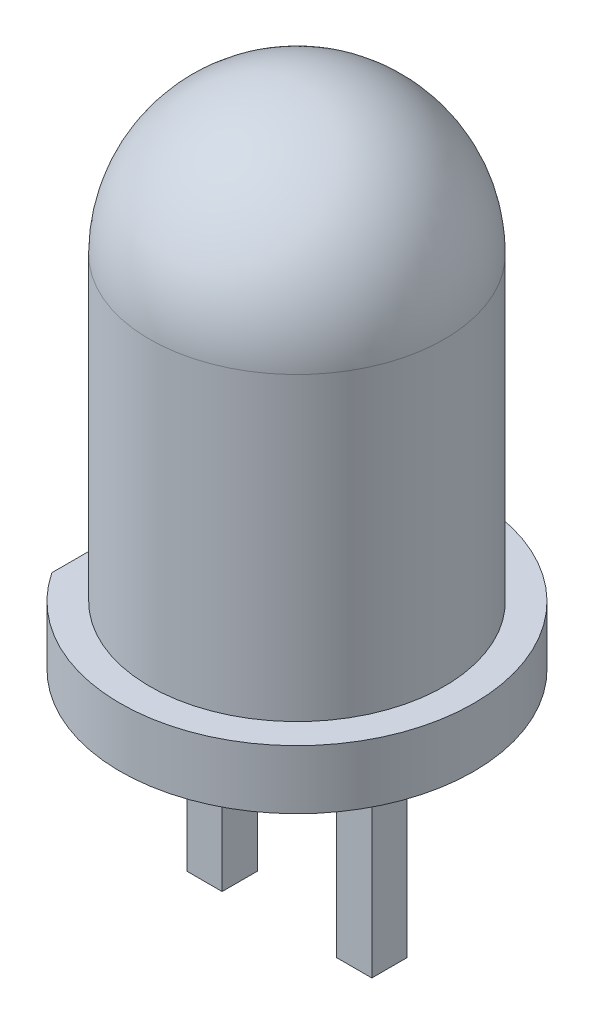
ISO-10303-21;
HEADER;
FILE_DESCRIPTION(('STEP AP214'),'2;1');
FILE_NAME('part.step','',(''),(''),'','','');
FILE_SCHEMA(('AUTOMOTIVE_DESIGN { 1 0 10303 214 1 1 1 1 }'));
ENDSEC;
DATA;
#1=APPLICATION_CONTEXT('core data for automotive mechanical design processes');
#2=APPLICATION_PROTOCOL_DEFINITION('international standard','automotive_design',2000,#1);
#3=PRODUCT_CONTEXT('',#1,'mechanical');
#4=PRODUCT('Part','Part','',(#3));
#5=PRODUCT_RELATED_PRODUCT_CATEGORY('part','',(#4));
#6=PRODUCT_DEFINITION_FORMATION('','',#4);
#7=PRODUCT_DEFINITION_CONTEXT('part definition',#1,'design');
#8=PRODUCT_DEFINITION('design','',#6,#7);
#9=PRODUCT_DEFINITION_SHAPE('','',#8);
#10=(LENGTH_UNIT() NAMED_UNIT(*) SI_UNIT(.MILLI.,.METRE.));
#11=(NAMED_UNIT(*) PLANE_ANGLE_UNIT() SI_UNIT($,.RADIAN.));
#12=(NAMED_UNIT(*) SI_UNIT($,.STERADIAN.) SOLID_ANGLE_UNIT());
#13=UNCERTAINTY_MEASURE_WITH_UNIT(LENGTH_MEASURE(1.E-05),#10,'distance_accuracy_value','');
#14=(GEOMETRIC_REPRESENTATION_CONTEXT(3) GLOBAL_UNCERTAINTY_ASSIGNED_CONTEXT((#13)) GLOBAL_UNIT_ASSIGNED_CONTEXT((#10,
#11,#12)) REPRESENTATION_CONTEXT('',''));
#15=CARTESIAN_POINT('',(0.,0.,0.));
#16=DIRECTION('',(0.,0.,1.));
#17=DIRECTION('',(1.,0.,0.));
#18=AXIS2_PLACEMENT_3D('',#15,#16,#17);
#19=CARTESIAN_POINT('',(0.,0.,0.));
#20=DIRECTION('',(0.,-1.,0.));
#21=DIRECTION('',(1.,0.,0.));
#22=AXIS2_PLACEMENT_3D('',#19,#20,#21);
#23=PLANE('',#22);
#24=DIRECTION('',(0.,0.,1.));
#25=VECTOR('',#24,1.);
#26=CARTESIAN_POINT('',(-2.5,0.,-2.));
#27=LINE('',#26,#25);
#28=CARTESIAN_POINT('',(-2.5,0.,-1.6583123951777));
#29=VERTEX_POINT('',#28);
#30=CARTESIAN_POINT('',(-2.5,0.,1.6583123951777));
#31=VERTEX_POINT('',#30);
#32=EDGE_CURVE('E124',#29,#31,#27,.T.);
#33=ORIENTED_EDGE('',*,*,#32,.F.);
#34=CARTESIAN_POINT('',(0.,0.,0.));
#35=DIRECTION('',(0.,1.,0.));
#36=DIRECTION('',(-1.,0.,0.));
#37=AXIS2_PLACEMENT_3D('',#34,#35,#36);
#38=CIRCLE('',#37,3.);
#39=EDGE_CURVE('E11',#31,#29,#38,.T.);
#40=ORIENTED_EDGE('',*,*,#39,.F.);
#41=EDGE_LOOP('',(#33,#40));
#42=FACE_BOUND('',#41,.T.);
#43=DIRECTION('',(-1.,0.,0.));
#44=VECTOR('',#43,1.);
#45=CARTESIAN_POINT('',(-1.57,0.,0.3));
#46=LINE('',#45,#44);
#47=CARTESIAN_POINT('',(-0.97,0.,0.3));
#48=VERTEX_POINT('',#47);
#49=CARTESIAN_POINT('',(-1.57,0.,0.3));
#50=VERTEX_POINT('',#49);
#51=EDGE_CURVE('E202',#48,#50,#46,.T.);
#52=ORIENTED_EDGE('',*,*,#51,.F.);
#53=DIRECTION('',(0.,0.,1.));
#54=VECTOR('',#53,1.);
#55=CARTESIAN_POINT('',(-0.97,0.,-0.3));
#56=LINE('',#55,#54);
#57=CARTESIAN_POINT('',(-0.97,0.,-0.3));
#58=VERTEX_POINT('',#57);
#59=EDGE_CURVE('E184',#58,#48,#56,.T.);
#60=ORIENTED_EDGE('',*,*,#59,.F.);
#61=DIRECTION('',(1.,0.,0.));
#62=VECTOR('',#61,1.);
#63=CARTESIAN_POINT('',(-1.57,0.,-0.3));
#64=LINE('',#63,#62);
#65=CARTESIAN_POINT('',(-1.57,0.,-0.3));
#66=VERTEX_POINT('',#65);
#67=EDGE_CURVE('E190',#66,#58,#64,.T.);
#68=ORIENTED_EDGE('',*,*,#67,.F.);
#69=DIRECTION('',(0.,0.,-1.));
#70=VECTOR('',#69,1.);
#71=CARTESIAN_POINT('',(-1.57,0.,-0.3));
#72=LINE('',#71,#70);
#73=EDGE_CURVE('E205',#50,#66,#72,.T.);
#74=ORIENTED_EDGE('',*,*,#73,.F.);
#75=EDGE_LOOP('',(#52,#60,#68,#74));
#76=FACE_BOUND('',#75,.T.);
#77=DIRECTION('',(-1.,0.,0.));
#78=VECTOR('',#77,1.);
#79=CARTESIAN_POINT('',(0.97,0.,0.3));
#80=LINE('',#79,#78);
#81=CARTESIAN_POINT('',(1.57,0.,0.3));
#82=VERTEX_POINT('',#81);
#83=CARTESIAN_POINT('',(0.97,0.,0.3));
#84=VERTEX_POINT('',#83);
#85=EDGE_CURVE('E146',#82,#84,#80,.T.);
#86=ORIENTED_EDGE('',*,*,#85,.F.);
#87=DIRECTION('',(0.,0.,1.));
#88=VECTOR('',#87,1.);
#89=CARTESIAN_POINT('',(1.57,0.,-0.3));
#90=LINE('',#89,#88);
#91=CARTESIAN_POINT('',(1.57,0.,-0.3));
#92=VERTEX_POINT('',#91);
#93=EDGE_CURVE('E140',#92,#82,#90,.T.);
#94=ORIENTED_EDGE('',*,*,#93,.F.);
#95=DIRECTION('',(1.,0.,0.));
#96=VECTOR('',#95,1.);
#97=CARTESIAN_POINT('',(0.97,0.,-0.3));
#98=LINE('',#97,#96);
#99=CARTESIAN_POINT('',(0.97,0.,-0.3));
#100=VERTEX_POINT('',#99);
#101=EDGE_CURVE('E156',#100,#92,#98,.T.);
#102=ORIENTED_EDGE('',*,*,#101,.F.);
#103=DIRECTION('',(0.,0.,-1.));
#104=VECTOR('',#103,1.);
#105=CARTESIAN_POINT('',(0.97,0.,-0.3));
#106=LINE('',#105,#104);
#107=EDGE_CURVE('E168',#84,#100,#106,.T.);
#108=ORIENTED_EDGE('',*,*,#107,.F.);
#109=EDGE_LOOP('',(#86,#94,#102,#108));
#110=FACE_BOUND('',#109,.T.);
#111=ADVANCED_FACE('F42',(#42,#76,#110),#23,.T.);
#112=CARTESIAN_POINT('',(0.,8.6,0.));
#113=DIRECTION('',(0.,1.,0.));
#114=DIRECTION('',(-1.,0.,0.));
#115=AXIS2_PLACEMENT_3D('',#112,#113,#114);
#116=CYLINDRICAL_SURFACE('',#115,3.);
#117=DIRECTION('',(0.,1.,0.));
#118=VECTOR('',#117,1.);
#119=CARTESIAN_POINT('',(-2.5,8.6,-1.6583123951777));
#120=LINE('',#119,#118);
#121=CARTESIAN_POINT('',(-2.5,0.999999999999999,-1.6583123951777));
#122=VERTEX_POINT('',#121);
#123=EDGE_CURVE('E121',#122,#29,#120,.F.);
#124=ORIENTED_EDGE('',*,*,#123,.F.);
#125=CARTESIAN_POINT('',(0.,0.999999999999999,0.));
#126=DIRECTION('',(0.,1.,0.));
#127=DIRECTION('',(-1.,0.,0.));
#128=AXIS2_PLACEMENT_3D('',#125,#126,#127);
#129=CIRCLE('',#128,3.);
#130=CARTESIAN_POINT('',(-2.5,0.999999999999999,1.6583123951777));
#131=VERTEX_POINT('',#130);
#132=EDGE_CURVE('E50',#131,#122,#129,.T.);
#133=ORIENTED_EDGE('',*,*,#132,.F.);
#134=DIRECTION('',(0.,1.,0.));
#135=VECTOR('',#134,1.);
#136=CARTESIAN_POINT('',(-2.5,8.6,1.6583123951777));
#137=LINE('',#136,#135);
#138=EDGE_CURVE('E138',#31,#131,#137,.T.);
#139=ORIENTED_EDGE('',*,*,#138,.F.);
#140=ORIENTED_EDGE('',*,*,#39,.T.);
#141=EDGE_LOOP('',(#124,#133,#139,#140));
#142=FACE_BOUND('',#141,.T.);
#143=ADVANCED_FACE('F137',(#142),#116,.T.);
#144=CARTESIAN_POINT('',(-3.,1.,0.));
#145=DIRECTION('',(0.,1.,0.));
#146=DIRECTION('',(-1.,0.,0.));
#147=AXIS2_PLACEMENT_3D('',#144,#145,#146);
#148=PLANE('',#147);
#149=DIRECTION('',(0.,0.,-1.));
#150=VECTOR('',#149,1.);
#151=CARTESIAN_POINT('',(-2.5,1.,0.));
#152=LINE('',#151,#150);
#153=CARTESIAN_POINT('',(-2.5,0.999999999999999,0.));
#154=VERTEX_POINT('',#153);
#155=EDGE_CURVE('E57',#131,#154,#152,.T.);
#156=ORIENTED_EDGE('',*,*,#155,.F.);
#157=ORIENTED_EDGE('',*,*,#132,.T.);
#158=EDGE_CURVE('E126',#154,#122,#152,.T.);
#159=ORIENTED_EDGE('',*,*,#158,.F.);
#160=CARTESIAN_POINT('',(0.,0.999999999999999,0.));
#161=DIRECTION('',(0.,1.,0.));
#162=DIRECTION('',(-1.,0.,0.));
#163=AXIS2_PLACEMENT_3D('',#160,#161,#162);
#164=CIRCLE('',#163,2.5);
#165=EDGE_CURVE('E228',#154,#154,#164,.T.);
#166=ORIENTED_EDGE('',*,*,#165,.F.);
#167=EDGE_LOOP('',(#156,#157,#159,#166));
#168=FACE_BOUND('',#167,.T.);
#169=ADVANCED_FACE('F233',(#168),#148,.T.);
#170=CARTESIAN_POINT('',(0.,8.6,0.));
#171=DIRECTION('',(0.,1.,0.));
#172=DIRECTION('',(-1.,0.,0.));
#173=AXIS2_PLACEMENT_3D('',#170,#171,#172);
#174=CYLINDRICAL_SURFACE('',#173,2.5);
#175=ORIENTED_EDGE('',*,*,#165,.T.);
#176=EDGE_LOOP('',(#175));
#177=FACE_BOUND('',#176,.T.);
#178=CARTESIAN_POINT('',(0.,6.1,0.));
#179=DIRECTION('',(0.,1.,0.));
#180=DIRECTION('',(-1.,0.,0.));
#181=AXIS2_PLACEMENT_3D('',#178,#179,#180);
#182=CIRCLE('',#181,2.5);
#183=CARTESIAN_POINT('',(-2.5,6.1,0.));
#184=VERTEX_POINT('',#183);
#185=EDGE_CURVE('E224',#184,#184,#182,.T.);
#186=ORIENTED_EDGE('',*,*,#185,.F.);
#187=EDGE_LOOP('',(#186));
#188=FACE_BOUND('',#187,.T.);
#189=ADVANCED_FACE('F236',(#177,#188),#174,.T.);
#190=CARTESIAN_POINT('',(0.,6.1,0.));
#191=DIRECTION('',(0.,1.,0.));
#192=DIRECTION('',(-1.,0.,0.));
#193=AXIS2_PLACEMENT_3D('',#190,#191,#192);
#194=SPHERICAL_SURFACE('',#193,2.5);
#195=ORIENTED_EDGE('',*,*,#185,.T.);
#196=EDGE_LOOP('',(#195));
#197=FACE_BOUND('',#196,.T.);
#198=ADVANCED_FACE('F239',(#197),#194,.T.);
#199=CARTESIAN_POINT('',(-0.97,-3.6,-0.3));
#200=DIRECTION('',(-1.,0.,0.));
#201=DIRECTION('',(0.,-1.,0.));
#202=AXIS2_PLACEMENT_3D('',#199,#200,#201);
#203=PLANE('',#202);
#204=ORIENTED_EDGE('',*,*,#59,.T.);
#205=DIRECTION('',(0.,1.,0.));
#206=VECTOR('',#205,1.);
#207=CARTESIAN_POINT('',(-0.97,-3.6,0.3));
#208=LINE('',#207,#206);
#209=CARTESIAN_POINT('',(-0.97,-3.6,0.3));
#210=VERTEX_POINT('',#209);
#211=EDGE_CURVE('E221',#210,#48,#208,.T.);
#212=ORIENTED_EDGE('',*,*,#211,.F.);
#213=DIRECTION('',(0.,0.,1.));
#214=VECTOR('',#213,1.);
#215=CARTESIAN_POINT('',(-0.97,-3.6,-0.3));
#216=LINE('',#215,#214);
#217=CARTESIAN_POINT('',(-0.97,-3.6,-0.3));
#218=VERTEX_POINT('',#217);
#219=EDGE_CURVE('E185',#218,#210,#216,.T.);
#220=ORIENTED_EDGE('',*,*,#219,.F.);
#221=DIRECTION('',(0.,1.,0.));
#222=VECTOR('',#221,1.);
#223=CARTESIAN_POINT('',(-0.97,-3.6,-0.3));
#224=LINE('',#223,#222);
#225=EDGE_CURVE('E199',#218,#58,#224,.T.);
#226=ORIENTED_EDGE('',*,*,#225,.T.);
#227=EDGE_LOOP('',(#204,#212,#220,#226));
#228=FACE_BOUND('',#227,.T.);
#229=ADVANCED_FACE('F244',(#228),#203,.F.);
#230=CARTESIAN_POINT('',(-1.57,-3.6,0.3));
#231=DIRECTION('',(0.,0.,-1.));
#232=DIRECTION('',(-1.,0.,0.));
#233=AXIS2_PLACEMENT_3D('',#230,#231,#232);
#234=PLANE('',#233);
#235=ORIENTED_EDGE('',*,*,#51,.T.);
#236=DIRECTION('',(0.,1.,0.));
#237=VECTOR('',#236,1.);
#238=CARTESIAN_POINT('',(-1.57,-3.6,0.3));
#239=LINE('',#238,#237);
#240=CARTESIAN_POINT('',(-1.57,-3.6,0.3));
#241=VERTEX_POINT('',#240);
#242=EDGE_CURVE('E217',#241,#50,#239,.T.);
#243=ORIENTED_EDGE('',*,*,#242,.F.);
#244=DIRECTION('',(-1.,0.,0.));
#245=VECTOR('',#244,1.);
#246=CARTESIAN_POINT('',(-1.57,-3.6,0.3));
#247=LINE('',#246,#245);
#248=EDGE_CURVE('E189',#210,#241,#247,.T.);
#249=ORIENTED_EDGE('',*,*,#248,.F.);
#250=ORIENTED_EDGE('',*,*,#211,.T.);
#251=EDGE_LOOP('',(#235,#243,#249,#250));
#252=FACE_BOUND('',#251,.T.);
#253=ADVANCED_FACE('F249',(#252),#234,.F.);
#254=CARTESIAN_POINT('',(-1.57,-3.6,-0.3));
#255=DIRECTION('',(1.,0.,0.));
#256=DIRECTION('',(0.,1.,0.));
#257=AXIS2_PLACEMENT_3D('',#254,#255,#256);
#258=PLANE('',#257);
#259=ORIENTED_EDGE('',*,*,#73,.T.);
#260=DIRECTION('',(0.,1.,0.));
#261=VECTOR('',#260,1.);
#262=CARTESIAN_POINT('',(-1.57,-3.6,-0.3));
#263=LINE('',#262,#261);
#264=CARTESIAN_POINT('',(-1.57,-3.6,-0.3));
#265=VERTEX_POINT('',#264);
#266=EDGE_CURVE('E214',#265,#66,#263,.T.);
#267=ORIENTED_EDGE('',*,*,#266,.F.);
#268=DIRECTION('',(0.,0.,-1.));
#269=VECTOR('',#268,1.);
#270=CARTESIAN_POINT('',(-1.57,-3.6,-0.3));
#271=LINE('',#270,#269);
#272=EDGE_CURVE('E193',#241,#265,#271,.T.);
#273=ORIENTED_EDGE('',*,*,#272,.F.);
#274=ORIENTED_EDGE('',*,*,#242,.T.);
#275=EDGE_LOOP('',(#259,#267,#273,#274));
#276=FACE_BOUND('',#275,.T.);
#277=ADVANCED_FACE('F281',(#276),#258,.F.);
#278=CARTESIAN_POINT('',(-1.57,-3.6,-0.3));
#279=DIRECTION('',(0.,0.,1.));
#280=DIRECTION('',(1.,0.,0.));
#281=AXIS2_PLACEMENT_3D('',#278,#279,#280);
#282=PLANE('',#281);
#283=ORIENTED_EDGE('',*,*,#67,.T.);
#284=ORIENTED_EDGE('',*,*,#225,.F.);
#285=DIRECTION('',(1.,0.,0.));
#286=VECTOR('',#285,1.);
#287=CARTESIAN_POINT('',(-1.57,-3.6,-0.3));
#288=LINE('',#287,#286);
#289=EDGE_CURVE('E196',#265,#218,#288,.T.);
#290=ORIENTED_EDGE('',*,*,#289,.F.);
#291=ORIENTED_EDGE('',*,*,#266,.T.);
#292=EDGE_LOOP('',(#283,#284,#290,#291));
#293=FACE_BOUND('',#292,.T.);
#294=ADVANCED_FACE('F290',(#293),#282,.F.);
#295=CARTESIAN_POINT('',(0.,-3.6,0.));
#296=DIRECTION('',(0.,1.,0.));
#297=DIRECTION('',(-1.,0.,0.));
#298=AXIS2_PLACEMENT_3D('',#295,#296,#297);
#299=PLANE('',#298);
#300=ORIENTED_EDGE('',*,*,#219,.T.);
#301=ORIENTED_EDGE('',*,*,#248,.T.);
#302=ORIENTED_EDGE('',*,*,#272,.T.);
#303=ORIENTED_EDGE('',*,*,#289,.T.);
#304=EDGE_LOOP('',(#300,#301,#302,#303));
#305=FACE_BOUND('',#304,.T.);
#306=ADVANCED_FACE('F299',(#305),#299,.F.);
#307=CARTESIAN_POINT('',(1.57,-3.6,-0.3));
#308=DIRECTION('',(-1.,0.,0.));
#309=DIRECTION('',(0.,-1.,0.));
#310=AXIS2_PLACEMENT_3D('',#307,#308,#309);
#311=PLANE('',#310);
#312=ORIENTED_EDGE('',*,*,#93,.T.);
#313=DIRECTION('',(0.,1.,0.));
#314=VECTOR('',#313,1.);
#315=CARTESIAN_POINT('',(1.57,-3.6,0.3));
#316=LINE('',#315,#314);
#317=CARTESIAN_POINT('',(1.57,-3.6,0.3));
#318=VERTEX_POINT('',#317);
#319=EDGE_CURVE('E181',#318,#82,#316,.T.);
#320=ORIENTED_EDGE('',*,*,#319,.F.);
#321=DIRECTION('',(0.,0.,1.));
#322=VECTOR('',#321,1.);
#323=CARTESIAN_POINT('',(1.57,-3.6,-0.3));
#324=LINE('',#323,#322);
#325=CARTESIAN_POINT('',(1.57,-3.6,-0.3));
#326=VERTEX_POINT('',#325);
#327=EDGE_CURVE('E151',#326,#318,#324,.T.);
#328=ORIENTED_EDGE('',*,*,#327,.F.);
#329=DIRECTION('',(0.,1.,0.));
#330=VECTOR('',#329,1.);
#331=CARTESIAN_POINT('',(1.57,-3.6,-0.3));
#332=LINE('',#331,#330);
#333=EDGE_CURVE('E164',#326,#92,#332,.T.);
#334=ORIENTED_EDGE('',*,*,#333,.T.);
#335=EDGE_LOOP('',(#312,#320,#328,#334));
#336=FACE_BOUND('',#335,.T.);
#337=ADVANCED_FACE('F308',(#336),#311,.F.);
#338=CARTESIAN_POINT('',(0.97,-3.6,0.3));
#339=DIRECTION('',(0.,0.,-1.));
#340=DIRECTION('',(-1.,0.,0.));
#341=AXIS2_PLACEMENT_3D('',#338,#339,#340);
#342=PLANE('',#341);
#343=ORIENTED_EDGE('',*,*,#85,.T.);
#344=DIRECTION('',(0.,1.,0.));
#345=VECTOR('',#344,1.);
#346=CARTESIAN_POINT('',(0.97,-3.6,0.3));
#347=LINE('',#346,#345);
#348=CARTESIAN_POINT('',(0.97,-3.6,0.3));
#349=VERTEX_POINT('',#348);
#350=EDGE_CURVE('E178',#349,#84,#347,.T.);
#351=ORIENTED_EDGE('',*,*,#350,.F.);
#352=DIRECTION('',(-1.,0.,0.));
#353=VECTOR('',#352,1.);
#354=CARTESIAN_POINT('',(0.97,-3.6,0.3));
#355=LINE('',#354,#353);
#356=EDGE_CURVE('E155',#318,#349,#355,.T.);
#357=ORIENTED_EDGE('',*,*,#356,.F.);
#358=ORIENTED_EDGE('',*,*,#319,.T.);
#359=EDGE_LOOP('',(#343,#351,#357,#358));
#360=FACE_BOUND('',#359,.T.);
#361=ADVANCED_FACE('F317',(#360),#342,.F.);
#362=CARTESIAN_POINT('',(0.97,-3.6,-0.3));
#363=DIRECTION('',(1.,0.,0.));
#364=DIRECTION('',(0.,1.,0.));
#365=AXIS2_PLACEMENT_3D('',#362,#363,#364);
#366=PLANE('',#365);
#367=ORIENTED_EDGE('',*,*,#107,.T.);
#368=DIRECTION('',(0.,1.,0.));
#369=VECTOR('',#368,1.);
#370=CARTESIAN_POINT('',(0.97,-3.6,-0.3));
#371=LINE('',#370,#369);
#372=CARTESIAN_POINT('',(0.97,-3.6,-0.3));
#373=VERTEX_POINT('',#372);
#374=EDGE_CURVE('E65',#373,#100,#371,.T.);
#375=ORIENTED_EDGE('',*,*,#374,.F.);
#376=DIRECTION('',(0.,0.,-1.));
#377=VECTOR('',#376,1.);
#378=CARTESIAN_POINT('',(0.97,-3.6,-0.3));
#379=LINE('',#378,#377);
#380=EDGE_CURVE('E159',#349,#373,#379,.T.);
#381=ORIENTED_EDGE('',*,*,#380,.F.);
#382=ORIENTED_EDGE('',*,*,#350,.T.);
#383=EDGE_LOOP('',(#367,#375,#381,#382));
#384=FACE_BOUND('',#383,.T.);
#385=ADVANCED_FACE('F326',(#384),#366,.F.);
#386=CARTESIAN_POINT('',(0.97,-3.6,-0.3));
#387=DIRECTION('',(0.,0.,1.));
#388=DIRECTION('',(1.,0.,0.));
#389=AXIS2_PLACEMENT_3D('',#386,#387,#388);
#390=PLANE('',#389);
#391=ORIENTED_EDGE('',*,*,#101,.T.);
#392=ORIENTED_EDGE('',*,*,#333,.F.);
#393=DIRECTION('',(1.,0.,0.));
#394=VECTOR('',#393,1.);
#395=CARTESIAN_POINT('',(0.97,-3.6,-0.3));
#396=LINE('',#395,#394);
#397=EDGE_CURVE('E162',#373,#326,#396,.T.);
#398=ORIENTED_EDGE('',*,*,#397,.F.);
#399=ORIENTED_EDGE('',*,*,#374,.T.);
#400=EDGE_LOOP('',(#391,#392,#398,#399));
#401=FACE_BOUND('',#400,.T.);
#402=ADVANCED_FACE('F335',(#401),#390,.F.);
#403=CARTESIAN_POINT('',(0.,-3.6,0.));
#404=DIRECTION('',(0.,1.,0.));
#405=DIRECTION('',(-1.,0.,0.));
#406=AXIS2_PLACEMENT_3D('',#403,#404,#405);
#407=PLANE('',#406);
#408=ORIENTED_EDGE('',*,*,#327,.T.);
#409=ORIENTED_EDGE('',*,*,#356,.T.);
#410=ORIENTED_EDGE('',*,*,#380,.T.);
#411=ORIENTED_EDGE('',*,*,#397,.T.);
#412=EDGE_LOOP('',(#408,#409,#410,#411));
#413=FACE_BOUND('',#412,.T.);
#414=ADVANCED_FACE('F344',(#413),#407,.F.);
#415=CARTESIAN_POINT('',(-2.5,8.6,-2.));
#416=DIRECTION('',(1.,0.,0.));
#417=DIRECTION('',(0.,1.,0.));
#418=AXIS2_PLACEMENT_3D('',#415,#416,#417);
#419=PLANE('',#418);
#420=ORIENTED_EDGE('',*,*,#138,.T.);
#421=ORIENTED_EDGE('',*,*,#155,.T.);
#422=ORIENTED_EDGE('',*,*,#158,.T.);
#423=ORIENTED_EDGE('',*,*,#123,.T.);
#424=ORIENTED_EDGE('',*,*,#32,.T.);
#425=EDGE_LOOP('',(#420,#421,#422,#423,#424));
#426=FACE_BOUND('',#425,.T.);
#427=ADVANCED_FACE('F123',(#426),#419,.F.);
#428=CLOSED_SHELL('',(#111,#143,#169,#189,#198,#229,#253,#277,#294,#306,#337,#361,#385,#402,
#414,#427));
#429=MANIFOLD_SOLID_BREP('B2',#428);
#430=ADVANCED_BREP_SHAPE_REPRESENTATION('',(#18,#429),#14);
#431=SHAPE_DEFINITION_REPRESENTATION(#9,#430);
ENDSEC;
END-ISO-10303-21;
